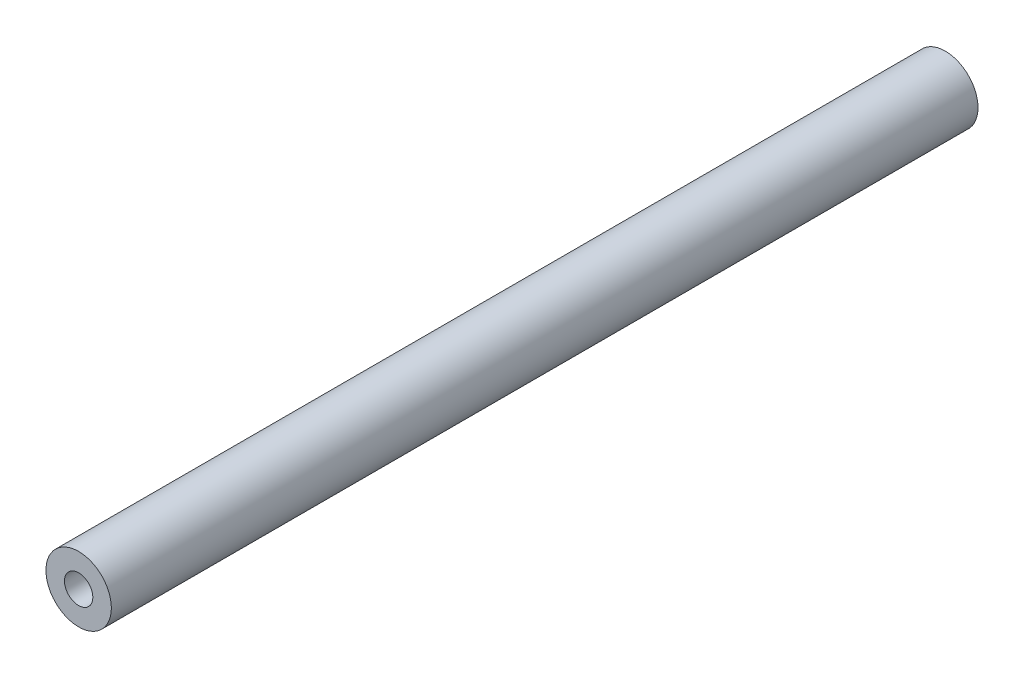
ISO-10303-21;
HEADER;
FILE_DESCRIPTION(('STEP AP214'),'2;1');
FILE_NAME('part.step','',(''),(''),'','','');
FILE_SCHEMA(('AUTOMOTIVE_DESIGN { 1 0 10303 214 1 1 1 1 }'));
ENDSEC;
DATA;
#1=APPLICATION_CONTEXT('core data for automotive mechanical design processes');
#2=APPLICATION_PROTOCOL_DEFINITION('international standard','automotive_design',2000,#1);
#3=PRODUCT_CONTEXT('',#1,'mechanical');
#4=PRODUCT('Part','Part','',(#3));
#5=PRODUCT_RELATED_PRODUCT_CATEGORY('part','',(#4));
#6=PRODUCT_DEFINITION_FORMATION('','',#4);
#7=PRODUCT_DEFINITION_CONTEXT('part definition',#1,'design');
#8=PRODUCT_DEFINITION('design','',#6,#7);
#9=PRODUCT_DEFINITION_SHAPE('','',#8);
#10=(LENGTH_UNIT() NAMED_UNIT(*) SI_UNIT(.MILLI.,.METRE.));
#11=(NAMED_UNIT(*) PLANE_ANGLE_UNIT() SI_UNIT($,.RADIAN.));
#12=(NAMED_UNIT(*) SI_UNIT($,.STERADIAN.) SOLID_ANGLE_UNIT());
#13=UNCERTAINTY_MEASURE_WITH_UNIT(LENGTH_MEASURE(1.E-05),#10,'distance_accuracy_value','');
#14=(GEOMETRIC_REPRESENTATION_CONTEXT(3) GLOBAL_UNCERTAINTY_ASSIGNED_CONTEXT((#13)) GLOBAL_UNIT_ASSIGNED_CONTEXT((#10,
#11,#12)) REPRESENTATION_CONTEXT('',''));
#15=CARTESIAN_POINT('',(0.,0.,0.));
#16=DIRECTION('',(0.,0.,1.));
#17=DIRECTION('',(1.,0.,0.));
#18=AXIS2_PLACEMENT_3D('',#15,#16,#17);
#19=CARTESIAN_POINT('',(-0.694032771342668,-5.95972470104974,-59.));
#20=DIRECTION('',(0.,0.,-1.));
#21=DIRECTION('',(0.115672128557112,0.993287450174957,0.));
#22=AXIS2_PLACEMENT_3D('',#19,#20,#21);
#23=PLANE('',#22);
#24=CARTESIAN_POINT('',(0.,0.,-59.));
#25=DIRECTION('',(0.,0.,-1.));
#26=DIRECTION('',(-1.,0.,0.));
#27=AXIS2_PLACEMENT_3D('',#24,#25,#26);
#28=CIRCLE('',#27,2.59999999999999);
#29=CARTESIAN_POINT('',(-2.59999999999999,0.,-59.));
#30=VERTEX_POINT('',#29);
#31=EDGE_CURVE('E60',#30,#30,#28,.T.);
#32=ORIENTED_EDGE('',*,*,#31,.F.);
#33=EDGE_LOOP('',(#32));
#34=FACE_BOUND('',#33,.T.);
#35=CARTESIAN_POINT('',(0.,0.,-59.));
#36=DIRECTION('',(0.,0.,-1.));
#37=DIRECTION('',(-1.,0.,0.));
#38=AXIS2_PLACEMENT_3D('',#35,#36,#37);
#39=CIRCLE('',#38,6.);
#40=CARTESIAN_POINT('',(-6.,0.,-59.));
#41=VERTEX_POINT('',#40);
#42=EDGE_CURVE('E11',#41,#41,#39,.F.);
#43=ORIENTED_EDGE('',*,*,#42,.F.);
#44=EDGE_LOOP('',(#43));
#45=FACE_BOUND('',#44,.T.);
#46=ADVANCED_FACE('F36',(#34,#45),#23,.T.);
#47=CARTESIAN_POINT('',(0.,0.,-77.9705627484771));
#48=DIRECTION('',(0.,0.,1.));
#49=DIRECTION('',(1.,0.,0.));
#50=AXIS2_PLACEMENT_3D('',#47,#48,#49);
#51=CYLINDRICAL_SURFACE('',#50,6.);
#52=ORIENTED_EDGE('',*,*,#42,.T.);
#53=EDGE_LOOP('',(#52));
#54=FACE_BOUND('',#53,.T.);
#55=CARTESIAN_POINT('',(0.,0.,100.));
#56=DIRECTION('',(0.,0.,1.));
#57=DIRECTION('',(1.,0.,0.));
#58=AXIS2_PLACEMENT_3D('',#55,#56,#57);
#59=CIRCLE('',#58,6.);
#60=CARTESIAN_POINT('',(6.,0.,100.));
#61=VERTEX_POINT('',#60);
#62=EDGE_CURVE('E43',#61,#61,#59,.T.);
#63=ORIENTED_EDGE('',*,*,#62,.F.);
#64=EDGE_LOOP('',(#63));
#65=FACE_BOUND('',#64,.T.);
#66=ADVANCED_FACE('F74',(#54,#65),#51,.T.);
#67=CARTESIAN_POINT('',(0.,0.,100.));
#68=DIRECTION('',(0.,0.,1.));
#69=DIRECTION('',(1.,0.,0.));
#70=AXIS2_PLACEMENT_3D('',#67,#68,#69);
#71=PLANE('',#70);
#72=CARTESIAN_POINT('',(0.,0.,100.));
#73=DIRECTION('',(0.,0.,1.));
#74=DIRECTION('',(1.,0.,0.));
#75=AXIS2_PLACEMENT_3D('',#72,#73,#74);
#76=CIRCLE('',#75,2.59999999999999);
#77=CARTESIAN_POINT('',(2.59999999999999,0.,100.));
#78=VERTEX_POINT('',#77);
#79=EDGE_CURVE('E59',#78,#78,#76,.T.);
#80=ORIENTED_EDGE('',*,*,#79,.F.);
#81=EDGE_LOOP('',(#80));
#82=FACE_BOUND('',#81,.T.);
#83=ORIENTED_EDGE('',*,*,#62,.T.);
#84=EDGE_LOOP('',(#83));
#85=FACE_BOUND('',#84,.T.);
#86=ADVANCED_FACE('F72',(#82,#85),#71,.T.);
#87=CARTESIAN_POINT('',(0.,0.,70.));
#88=DIRECTION('',(0.,0.,1.));
#89=DIRECTION('',(1.,0.,0.));
#90=AXIS2_PLACEMENT_3D('',#87,#88,#89);
#91=CONICAL_SURFACE('',#90,2.59999999999996,1.02974425867664);
#92=CARTESIAN_POINT('',(0.,0.,68.4377623905283));
#93=VERTEX_POINT('',#92);
#94=VERTEX_LOOP('',#93);
#95=FACE_BOUND('',#94,.T.);
#96=CARTESIAN_POINT('',(0.,0.,70.));
#97=DIRECTION('',(0.,0.,1.));
#98=DIRECTION('',(1.,0.,0.));
#99=AXIS2_PLACEMENT_3D('',#96,#97,#98);
#100=CIRCLE('',#99,2.59999999999996);
#101=CARTESIAN_POINT('',(2.59999999999996,0.,70.));
#102=VERTEX_POINT('',#101);
#103=EDGE_CURVE('E63',#102,#102,#100,.T.);
#104=ORIENTED_EDGE('',*,*,#103,.T.);
#105=EDGE_LOOP('',(#104));
#106=FACE_BOUND('',#105,.T.);
#107=ADVANCED_FACE('F81',(#95,#106),#91,.F.);
#108=CARTESIAN_POINT('',(0.,0.,100.));
#109=DIRECTION('',(0.,0.,1.));
#110=DIRECTION('',(1.,0.,0.));
#111=AXIS2_PLACEMENT_3D('',#108,#109,#110);
#112=CYLINDRICAL_SURFACE('',#111,2.59999999999997);
#113=ORIENTED_EDGE('',*,*,#103,.F.);
#114=EDGE_LOOP('',(#113));
#115=FACE_BOUND('',#114,.T.);
#116=ORIENTED_EDGE('',*,*,#79,.T.);
#117=EDGE_LOOP('',(#116));
#118=FACE_BOUND('',#117,.T.);
#119=ADVANCED_FACE('F53',(#115,#118),#112,.F.);
#120=CARTESIAN_POINT('',(0.,0.,-29.));
#121=DIRECTION('',(0.,0.,-1.));
#122=DIRECTION('',(-1.,0.,0.));
#123=AXIS2_PLACEMENT_3D('',#120,#121,#122);
#124=CONICAL_SURFACE('',#123,2.59999999999999,1.02974425867665);
#125=CARTESIAN_POINT('',(0.,0.,-27.4377623905283));
#126=VERTEX_POINT('',#125);
#127=VERTEX_LOOP('',#126);
#128=FACE_BOUND('',#127,.T.);
#129=CARTESIAN_POINT('',(0.,0.,-29.));
#130=DIRECTION('',(0.,0.,-1.));
#131=DIRECTION('',(-1.,0.,0.));
#132=AXIS2_PLACEMENT_3D('',#129,#130,#131);
#133=CIRCLE('',#132,2.59999999999999);
#134=CARTESIAN_POINT('',(-2.59999999999999,0.,-29.));
#135=VERTEX_POINT('',#134);
#136=EDGE_CURVE('E57',#135,#135,#133,.T.);
#137=ORIENTED_EDGE('',*,*,#136,.T.);
#138=EDGE_LOOP('',(#137));
#139=FACE_BOUND('',#138,.T.);
#140=ADVANCED_FACE('F49',(#128,#139),#124,.F.);
#141=CARTESIAN_POINT('',(0.,0.,-59.));
#142=DIRECTION('',(0.,0.,-1.));
#143=DIRECTION('',(-1.,0.,0.));
#144=AXIS2_PLACEMENT_3D('',#141,#142,#143);
#145=CYLINDRICAL_SURFACE('',#144,2.59999999999999);
#146=ORIENTED_EDGE('',*,*,#136,.F.);
#147=EDGE_LOOP('',(#146));
#148=FACE_BOUND('',#147,.T.);
#149=ORIENTED_EDGE('',*,*,#31,.T.);
#150=EDGE_LOOP('',(#149));
#151=FACE_BOUND('',#150,.T.);
#152=ADVANCED_FACE('F52',(#148,#151),#145,.F.);
#153=CLOSED_SHELL('',(#46,#66,#86,#107,#119,#140,#152));
#154=MANIFOLD_SOLID_BREP('B2',#153);
#155=ADVANCED_BREP_SHAPE_REPRESENTATION('',(#18,#154),#14);
#156=SHAPE_DEFINITION_REPRESENTATION(#9,#155);
ENDSEC;
END-ISO-10303-21;
